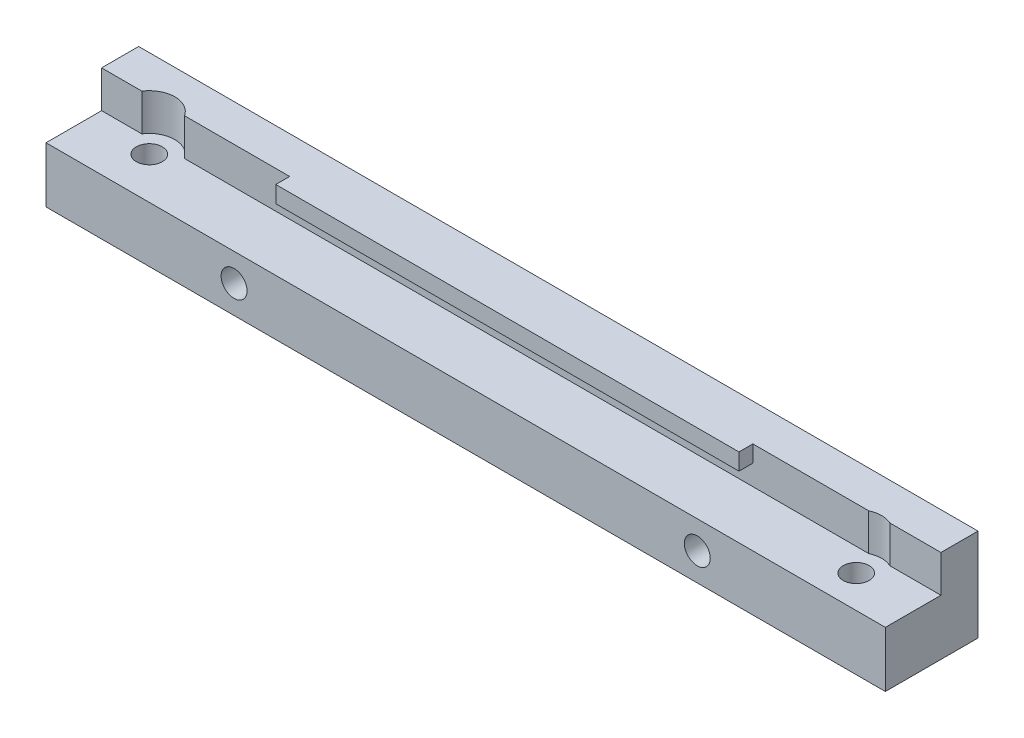
ISO-10303-21;
HEADER;
FILE_DESCRIPTION(('STEP AP214'),'2;1');
FILE_NAME('part.step','',(''),(''),'','','');
FILE_SCHEMA(('AUTOMOTIVE_DESIGN { 1 0 10303 214 1 1 1 1 }'));
ENDSEC;
DATA;
#1=APPLICATION_CONTEXT('core data for automotive mechanical design processes');
#2=APPLICATION_PROTOCOL_DEFINITION('international standard','automotive_design',2000,#1);
#3=PRODUCT_CONTEXT('',#1,'mechanical');
#4=PRODUCT('Part','Part','',(#3));
#5=PRODUCT_RELATED_PRODUCT_CATEGORY('part','',(#4));
#6=PRODUCT_DEFINITION_FORMATION('','',#4);
#7=PRODUCT_DEFINITION_CONTEXT('part definition',#1,'design');
#8=PRODUCT_DEFINITION('design','',#6,#7);
#9=PRODUCT_DEFINITION_SHAPE('','',#8);
#10=(LENGTH_UNIT() NAMED_UNIT(*) SI_UNIT(.MILLI.,.METRE.));
#11=(NAMED_UNIT(*) PLANE_ANGLE_UNIT() SI_UNIT($,.RADIAN.));
#12=(NAMED_UNIT(*) SI_UNIT($,.STERADIAN.) SOLID_ANGLE_UNIT());
#13=UNCERTAINTY_MEASURE_WITH_UNIT(LENGTH_MEASURE(1.E-05),#10,'distance_accuracy_value','');
#14=(GEOMETRIC_REPRESENTATION_CONTEXT(3) GLOBAL_UNCERTAINTY_ASSIGNED_CONTEXT((#13)) GLOBAL_UNIT_ASSIGNED_CONTEXT((#10,
#11,#12)) REPRESENTATION_CONTEXT('',''));
#15=CARTESIAN_POINT('',(0.,0.,0.));
#16=DIRECTION('',(0.,0.,1.));
#17=DIRECTION('',(1.,0.,0.));
#18=AXIS2_PLACEMENT_3D('',#15,#16,#17);
#19=CARTESIAN_POINT('',(0.,0.,4.));
#20=DIRECTION('',(0.,0.,1.));
#21=DIRECTION('',(1.,0.,0.));
#22=AXIS2_PLACEMENT_3D('',#19,#20,#21);
#23=PLANE('',#22);
#24=DIRECTION('',(0.,1.,0.));
#25=VECTOR('',#24,1.);
#26=CARTESIAN_POINT('',(85.095643923739,6.,4.));
#27=LINE('',#26,#25);
#28=CARTESIAN_POINT('',(85.095643923739,6.,4.));
#29=VERTEX_POINT('',#28);
#30=CARTESIAN_POINT('',(85.095643923739,10.,4.));
#31=VERTEX_POINT('',#30);
#32=EDGE_CURVE('E48',#29,#31,#27,.T.);
#33=ORIENTED_EDGE('',*,*,#32,.F.);
#34=DIRECTION('',(1.,0.,0.));
#35=VECTOR('',#34,1.);
#36=CARTESIAN_POINT('',(0.,6.,4.));
#37=LINE('',#36,#35);
#38=CARTESIAN_POINT('',(90.6,6.,4.));
#39=VERTEX_POINT('',#38);
#40=EDGE_CURVE('E144',#29,#39,#37,.T.);
#41=ORIENTED_EDGE('',*,*,#40,.T.);
#42=DIRECTION('',(0.,1.,0.));
#43=VECTOR('',#42,1.);
#44=CARTESIAN_POINT('',(90.6,10.,4.));
#45=LINE('',#44,#43);
#46=CARTESIAN_POINT('',(90.6,10.,4.));
#47=VERTEX_POINT('',#46);
#48=EDGE_CURVE('E164',#39,#47,#45,.T.);
#49=ORIENTED_EDGE('',*,*,#48,.T.);
#50=DIRECTION('',(-1.,0.,0.));
#51=VECTOR('',#50,1.);
#52=CARTESIAN_POINT('',(0.,10.,4.));
#53=LINE('',#52,#51);
#54=EDGE_CURVE('E147',#47,#31,#53,.T.);
#55=ORIENTED_EDGE('',*,*,#54,.T.);
#56=EDGE_LOOP('',(#33,#41,#49,#55));
#57=FACE_BOUND('',#56,.T.);
#58=ADVANCED_FACE('F33',(#57),#23,.T.);
#59=DIRECTION('',(0.,1.,0.));
#60=VECTOR('',#59,1.);
#61=CARTESIAN_POINT('',(82.804356076261,6.,4.));
#62=LINE('',#61,#60);
#63=CARTESIAN_POINT('',(82.804356076261,10.,4.));
#64=VERTEX_POINT('',#63);
#65=CARTESIAN_POINT('',(82.804356076261,6.,4.));
#66=VERTEX_POINT('',#65);
#67=EDGE_CURVE('E135',#64,#66,#62,.F.);
#68=ORIENTED_EDGE('',*,*,#67,.F.);
#69=CARTESIAN_POINT('',(70.3,10.,4.));
#70=VERTEX_POINT('',#69);
#71=EDGE_CURVE('E170',#64,#70,#53,.T.);
#72=ORIENTED_EDGE('',*,*,#71,.T.);
#73=DIRECTION('',(0.,1.,0.));
#74=VECTOR('',#73,1.);
#75=CARTESIAN_POINT('',(70.3,10.,4.));
#76=LINE('',#75,#74);
#77=CARTESIAN_POINT('',(70.3,8.2,4.));
#78=VERTEX_POINT('',#77);
#79=EDGE_CURVE('E238',#78,#70,#76,.T.);
#80=ORIENTED_EDGE('',*,*,#79,.F.);
#81=DIRECTION('',(1.,0.,0.));
#82=VECTOR('',#81,1.);
#83=CARTESIAN_POINT('',(20.3,8.2,4.));
#84=LINE('',#83,#82);
#85=CARTESIAN_POINT('',(20.3,8.2,4.));
#86=VERTEX_POINT('',#85);
#87=EDGE_CURVE('E251',#86,#78,#84,.T.);
#88=ORIENTED_EDGE('',*,*,#87,.F.);
#89=DIRECTION('',(0.,-1.,0.));
#90=VECTOR('',#89,1.);
#91=CARTESIAN_POINT('',(20.3,10.,4.));
#92=LINE('',#91,#90);
#93=CARTESIAN_POINT('',(20.3,10.,4.));
#94=VERTEX_POINT('',#93);
#95=EDGE_CURVE('E235',#94,#86,#92,.T.);
#96=ORIENTED_EDGE('',*,*,#95,.F.);
#97=CARTESIAN_POINT('',(8.95488611432322,10.,4.));
#98=VERTEX_POINT('',#97);
#99=EDGE_CURVE('E168',#94,#98,#53,.T.);
#100=ORIENTED_EDGE('',*,*,#99,.T.);
#101=DIRECTION('',(0.,1.,0.));
#102=VECTOR('',#101,1.);
#103=CARTESIAN_POINT('',(8.95488611432322,6.,4.));
#104=LINE('',#103,#102);
#105=CARTESIAN_POINT('',(8.95488611432322,6.,4.));
#106=VERTEX_POINT('',#105);
#107=EDGE_CURVE('E56',#106,#98,#104,.T.);
#108=ORIENTED_EDGE('',*,*,#107,.F.);
#109=EDGE_CURVE('E155',#106,#66,#37,.T.);
#110=ORIENTED_EDGE('',*,*,#109,.T.);
#111=EDGE_LOOP('',(#68,#72,#80,#88,#96,#100,#108,#110));
#112=FACE_BOUND('',#111,.T.);
#113=ADVANCED_FACE('F233',(#112),#23,.T.);
#114=DIRECTION('',(0.,1.,0.));
#115=VECTOR('',#114,1.);
#116=CARTESIAN_POINT('',(4.34511388567678,6.,4.));
#117=LINE('',#116,#115);
#118=CARTESIAN_POINT('',(4.34511388567678,10.,4.));
#119=VERTEX_POINT('',#118);
#120=CARTESIAN_POINT('',(4.34511388567678,6.,4.));
#121=VERTEX_POINT('',#120);
#122=EDGE_CURVE('E226',#119,#121,#117,.F.);
#123=ORIENTED_EDGE('',*,*,#122,.F.);
#124=CARTESIAN_POINT('',(0.,10.,4.));
#125=VERTEX_POINT('',#124);
#126=EDGE_CURVE('E167',#119,#125,#53,.T.);
#127=ORIENTED_EDGE('',*,*,#126,.T.);
#128=DIRECTION('',(0.,-1.,0.));
#129=VECTOR('',#128,1.);
#130=CARTESIAN_POINT('',(0.,10.,4.));
#131=LINE('',#130,#129);
#132=CARTESIAN_POINT('',(0.,6.,4.));
#133=VERTEX_POINT('',#132);
#134=EDGE_CURVE('E156',#125,#133,#131,.T.);
#135=ORIENTED_EDGE('',*,*,#134,.T.);
#136=EDGE_CURVE('E158',#133,#121,#37,.T.);
#137=ORIENTED_EDGE('',*,*,#136,.T.);
#138=EDGE_LOOP('',(#123,#127,#135,#137));
#139=FACE_BOUND('',#138,.T.);
#140=ADVANCED_FACE('F225',(#139),#23,.T.);
#141=CARTESIAN_POINT('',(0.,10.,10.));
#142=DIRECTION('',(0.,-1.,0.));
#143=DIRECTION('',(0.,0.,-1.));
#144=AXIS2_PLACEMENT_3D('',#141,#142,#143);
#145=PLANE('',#144);
#146=ORIENTED_EDGE('',*,*,#71,.F.);
#147=CARTESIAN_POINT('',(83.95,10.,6.5));
#148=DIRECTION('',(0.,1.,0.));
#149=DIRECTION('',(0.,0.,1.));
#150=AXIS2_PLACEMENT_3D('',#147,#148,#149);
#151=CIRCLE('',#150,2.75000000000001);
#152=EDGE_CURVE('E140',#31,#64,#151,.T.);
#153=ORIENTED_EDGE('',*,*,#152,.F.);
#154=ORIENTED_EDGE('',*,*,#54,.F.);
#155=DIRECTION('',(0.,0.,-1.));
#156=VECTOR('',#155,1.);
#157=CARTESIAN_POINT('',(90.6,10.,10.));
#158=LINE('',#157,#156);
#159=CARTESIAN_POINT('',(90.6,10.,0.));
#160=VERTEX_POINT('',#159);
#161=EDGE_CURVE('E197',#47,#160,#158,.T.);
#162=ORIENTED_EDGE('',*,*,#161,.T.);
#163=DIRECTION('',(-1.,0.,0.));
#164=VECTOR('',#163,1.);
#165=CARTESIAN_POINT('',(0.,10.,0.));
#166=LINE('',#165,#164);
#167=CARTESIAN_POINT('',(0.,10.,0.));
#168=VERTEX_POINT('',#167);
#169=EDGE_CURVE('E181',#160,#168,#166,.T.);
#170=ORIENTED_EDGE('',*,*,#169,.T.);
#171=DIRECTION('',(0.,0.,-1.));
#172=VECTOR('',#171,1.);
#173=CARTESIAN_POINT('',(0.,10.,10.));
#174=LINE('',#173,#172);
#175=EDGE_CURVE('E186',#125,#168,#174,.T.);
#176=ORIENTED_EDGE('',*,*,#175,.F.);
#177=ORIENTED_EDGE('',*,*,#126,.F.);
#178=CARTESIAN_POINT('',(6.65,10.,5.5));
#179=DIRECTION('',(0.,1.,0.));
#180=DIRECTION('',(0.,0.,1.));
#181=AXIS2_PLACEMENT_3D('',#178,#179,#180);
#182=CIRCLE('',#181,2.75);
#183=EDGE_CURVE('E148',#98,#119,#182,.T.);
#184=ORIENTED_EDGE('',*,*,#183,.F.);
#185=ORIENTED_EDGE('',*,*,#99,.F.);
#186=DIRECTION('',(0.,0.,-1.));
#187=VECTOR('',#186,1.);
#188=CARTESIAN_POINT('',(20.3,10.,5.5));
#189=LINE('',#188,#187);
#190=CARTESIAN_POINT('',(20.3,10.,5.5));
#191=VERTEX_POINT('',#190);
#192=EDGE_CURVE('E254',#191,#94,#189,.T.);
#193=ORIENTED_EDGE('',*,*,#192,.F.);
#194=DIRECTION('',(-1.,0.,0.));
#195=VECTOR('',#194,1.);
#196=CARTESIAN_POINT('',(20.3,10.,5.5));
#197=LINE('',#196,#195);
#198=CARTESIAN_POINT('',(70.3,10.,5.5));
#199=VERTEX_POINT('',#198);
#200=EDGE_CURVE('E253',#199,#191,#197,.T.);
#201=ORIENTED_EDGE('',*,*,#200,.F.);
#202=DIRECTION('',(0.,0.,-1.));
#203=VECTOR('',#202,1.);
#204=CARTESIAN_POINT('',(70.3,10.,5.5));
#205=LINE('',#204,#203);
#206=EDGE_CURVE('E246',#199,#70,#205,.T.);
#207=ORIENTED_EDGE('',*,*,#206,.T.);
#208=EDGE_LOOP('',(#146,#153,#154,#162,#170,#176,#177,#184,#185,#193,#201,#207));
#209=FACE_BOUND('',#208,.T.);
#210=ADVANCED_FACE('F214',(#209),#145,.F.);
#211=CARTESIAN_POINT('',(0.,0.,10.));
#212=DIRECTION('',(1.,0.,0.));
#213=DIRECTION('',(0.,0.,-1.));
#214=AXIS2_PLACEMENT_3D('',#211,#212,#213);
#215=PLANE('',#214);
#216=DIRECTION('',(0.,-1.,0.));
#217=VECTOR('',#216,1.);
#218=CARTESIAN_POINT('',(0.,0.,10.));
#219=LINE('',#218,#217);
#220=CARTESIAN_POINT('',(0.,6.,10.));
#221=VERTEX_POINT('',#220);
#222=CARTESIAN_POINT('',(0.,0.,10.));
#223=VERTEX_POINT('',#222);
#224=EDGE_CURVE('E178',#221,#223,#219,.T.);
#225=ORIENTED_EDGE('',*,*,#224,.F.);
#226=DIRECTION('',(0.,0.,1.));
#227=VECTOR('',#226,1.);
#228=CARTESIAN_POINT('',(0.,6.,4.));
#229=LINE('',#228,#227);
#230=EDGE_CURVE('E172',#133,#221,#229,.T.);
#231=ORIENTED_EDGE('',*,*,#230,.F.);
#232=ORIENTED_EDGE('',*,*,#134,.F.);
#233=ORIENTED_EDGE('',*,*,#175,.T.);
#234=DIRECTION('',(0.,-1.,0.));
#235=VECTOR('',#234,1.);
#236=CARTESIAN_POINT('',(0.,0.,0.));
#237=LINE('',#236,#235);
#238=CARTESIAN_POINT('',(0.,0.,0.));
#239=VERTEX_POINT('',#238);
#240=EDGE_CURVE('E176',#168,#239,#237,.T.);
#241=ORIENTED_EDGE('',*,*,#240,.T.);
#242=DIRECTION('',(0.,0.,-1.));
#243=VECTOR('',#242,1.);
#244=CARTESIAN_POINT('',(0.,0.,10.));
#245=LINE('',#244,#243);
#246=EDGE_CURVE('E11',#223,#239,#245,.T.);
#247=ORIENTED_EDGE('',*,*,#246,.F.);
#248=EDGE_LOOP('',(#225,#231,#232,#233,#241,#247));
#249=FACE_BOUND('',#248,.T.);
#250=ADVANCED_FACE('F35',(#249),#215,.F.);
#251=CARTESIAN_POINT('',(0.,0.,10.));
#252=DIRECTION('',(0.,1.,0.));
#253=DIRECTION('',(0.,0.,1.));
#254=AXIS2_PLACEMENT_3D('',#251,#252,#253);
#255=PLANE('',#254);
#256=CARTESIAN_POINT('',(83.95,0.,6.5));
#257=DIRECTION('',(0.,1.,0.));
#258=DIRECTION('',(0.,0.,1.));
#259=AXIS2_PLACEMENT_3D('',#256,#257,#258);
#260=CIRCLE('',#259,1.4);
#261=CARTESIAN_POINT('',(83.95,0.,7.9));
#262=VERTEX_POINT('',#261);
#263=EDGE_CURVE('E263',#262,#262,#260,.T.);
#264=ORIENTED_EDGE('',*,*,#263,.T.);
#265=EDGE_LOOP('',(#264));
#266=FACE_BOUND('',#265,.T.);
#267=CARTESIAN_POINT('',(6.65,0.,5.5));
#268=DIRECTION('',(0.,1.,0.));
#269=DIRECTION('',(0.,0.,1.));
#270=AXIS2_PLACEMENT_3D('',#267,#268,#269);
#271=CIRCLE('',#270,1.4);
#272=CARTESIAN_POINT('',(6.65,0.,6.9));
#273=VERTEX_POINT('',#272);
#274=EDGE_CURVE('E174',#273,#273,#271,.T.);
#275=ORIENTED_EDGE('',*,*,#274,.T.);
#276=EDGE_LOOP('',(#275));
#277=FACE_BOUND('',#276,.T.);
#278=DIRECTION('',(1.,0.,0.));
#279=VECTOR('',#278,1.);
#280=CARTESIAN_POINT('',(0.,0.,0.));
#281=LINE('',#280,#279);
#282=CARTESIAN_POINT('',(90.6,0.,0.));
#283=VERTEX_POINT('',#282);
#284=EDGE_CURVE('E189',#239,#283,#281,.T.);
#285=ORIENTED_EDGE('',*,*,#284,.T.);
#286=DIRECTION('',(0.,0.,-1.));
#287=VECTOR('',#286,1.);
#288=CARTESIAN_POINT('',(90.6,0.,10.));
#289=LINE('',#288,#287);
#290=CARTESIAN_POINT('',(90.6,0.,10.));
#291=VERTEX_POINT('',#290);
#292=EDGE_CURVE('E41',#291,#283,#289,.T.);
#293=ORIENTED_EDGE('',*,*,#292,.F.);
#294=DIRECTION('',(1.,0.,0.));
#295=VECTOR('',#294,1.);
#296=CARTESIAN_POINT('',(0.,0.,10.));
#297=LINE('',#296,#295);
#298=EDGE_CURVE('E180',#223,#291,#297,.T.);
#299=ORIENTED_EDGE('',*,*,#298,.F.);
#300=ORIENTED_EDGE('',*,*,#246,.T.);
#301=EDGE_LOOP('',(#285,#293,#299,#300));
#302=FACE_BOUND('',#301,.T.);
#303=ADVANCED_FACE('F221',(#266,#277,#302),#255,.F.);
#304=CARTESIAN_POINT('',(90.6,0.,10.));
#305=DIRECTION('',(-1.,0.,0.));
#306=DIRECTION('',(0.,0.,1.));
#307=AXIS2_PLACEMENT_3D('',#304,#305,#306);
#308=PLANE('',#307);
#309=ORIENTED_EDGE('',*,*,#48,.F.);
#310=DIRECTION('',(0.,0.,1.));
#311=VECTOR('',#310,1.);
#312=CARTESIAN_POINT('',(90.6,6.,4.));
#313=LINE('',#312,#311);
#314=CARTESIAN_POINT('',(90.6,6.,10.));
#315=VERTEX_POINT('',#314);
#316=EDGE_CURVE('E153',#39,#315,#313,.T.);
#317=ORIENTED_EDGE('',*,*,#316,.T.);
#318=DIRECTION('',(0.,1.,0.));
#319=VECTOR('',#318,1.);
#320=CARTESIAN_POINT('',(90.6,0.,10.));
#321=LINE('',#320,#319);
#322=EDGE_CURVE('E183',#291,#315,#321,.T.);
#323=ORIENTED_EDGE('',*,*,#322,.F.);
#324=ORIENTED_EDGE('',*,*,#292,.T.);
#325=DIRECTION('',(0.,1.,0.));
#326=VECTOR('',#325,1.);
#327=CARTESIAN_POINT('',(90.6,0.,0.));
#328=LINE('',#327,#326);
#329=EDGE_CURVE('E191',#283,#160,#328,.T.);
#330=ORIENTED_EDGE('',*,*,#329,.T.);
#331=ORIENTED_EDGE('',*,*,#161,.F.);
#332=EDGE_LOOP('',(#309,#317,#323,#324,#330,#331));
#333=FACE_BOUND('',#332,.T.);
#334=ADVANCED_FACE('F203',(#333),#308,.F.);
#335=CARTESIAN_POINT('',(0.,0.,10.));
#336=DIRECTION('',(0.,0.,-1.));
#337=DIRECTION('',(-1.,0.,0.));
#338=AXIS2_PLACEMENT_3D('',#335,#336,#337);
#339=PLANE('',#338);
#340=CARTESIAN_POINT('',(70.3,3.,10.));
#341=DIRECTION('',(0.,0.,1.));
#342=DIRECTION('',(1.,0.,0.));
#343=AXIS2_PLACEMENT_3D('',#340,#341,#342);
#344=CIRCLE('',#343,1.4);
#345=CARTESIAN_POINT('',(71.7,3.,10.));
#346=VERTEX_POINT('',#345);
#347=EDGE_CURVE('E456',#346,#346,#344,.T.);
#348=ORIENTED_EDGE('',*,*,#347,.F.);
#349=EDGE_LOOP('',(#348));
#350=FACE_BOUND('',#349,.T.);
#351=CARTESIAN_POINT('',(20.3,3.,10.));
#352=DIRECTION('',(0.,0.,1.));
#353=DIRECTION('',(1.,0.,0.));
#354=AXIS2_PLACEMENT_3D('',#351,#352,#353);
#355=CIRCLE('',#354,1.4);
#356=CARTESIAN_POINT('',(21.7,3.,10.));
#357=VERTEX_POINT('',#356);
#358=EDGE_CURVE('E458',#357,#357,#355,.T.);
#359=ORIENTED_EDGE('',*,*,#358,.F.);
#360=EDGE_LOOP('',(#359));
#361=FACE_BOUND('',#360,.T.);
#362=ORIENTED_EDGE('',*,*,#322,.T.);
#363=DIRECTION('',(1.,0.,0.));
#364=VECTOR('',#363,1.);
#365=CARTESIAN_POINT('',(0.,6.,10.));
#366=LINE('',#365,#364);
#367=EDGE_CURVE('E160',#221,#315,#366,.T.);
#368=ORIENTED_EDGE('',*,*,#367,.F.);
#369=ORIENTED_EDGE('',*,*,#224,.T.);
#370=ORIENTED_EDGE('',*,*,#298,.T.);
#371=EDGE_LOOP('',(#362,#368,#369,#370));
#372=FACE_BOUND('',#371,.T.);
#373=ADVANCED_FACE('F218',(#350,#361,#372),#339,.F.);
#374=CARTESIAN_POINT('',(0.,0.,0.));
#375=DIRECTION('',(0.,0.,-1.));
#376=DIRECTION('',(-1.,0.,0.));
#377=AXIS2_PLACEMENT_3D('',#374,#375,#376);
#378=PLANE('',#377);
#379=CARTESIAN_POINT('',(70.3,3.,0.));
#380=DIRECTION('',(0.,0.,1.));
#381=DIRECTION('',(1.,0.,0.));
#382=AXIS2_PLACEMENT_3D('',#379,#380,#381);
#383=CIRCLE('',#382,1.4);
#384=CARTESIAN_POINT('',(71.7,3.,0.));
#385=VERTEX_POINT('',#384);
#386=EDGE_CURVE('E453',#385,#385,#383,.T.);
#387=ORIENTED_EDGE('',*,*,#386,.T.);
#388=EDGE_LOOP('',(#387));
#389=FACE_BOUND('',#388,.T.);
#390=CARTESIAN_POINT('',(20.3,3.,0.));
#391=DIRECTION('',(0.,0.,1.));
#392=DIRECTION('',(1.,0.,0.));
#393=AXIS2_PLACEMENT_3D('',#390,#391,#392);
#394=CIRCLE('',#393,1.4);
#395=CARTESIAN_POINT('',(21.7,3.,0.));
#396=VERTEX_POINT('',#395);
#397=EDGE_CURVE('E461',#396,#396,#394,.T.);
#398=ORIENTED_EDGE('',*,*,#397,.T.);
#399=EDGE_LOOP('',(#398));
#400=FACE_BOUND('',#399,.T.);
#401=ORIENTED_EDGE('',*,*,#240,.F.);
#402=ORIENTED_EDGE('',*,*,#169,.F.);
#403=ORIENTED_EDGE('',*,*,#329,.F.);
#404=ORIENTED_EDGE('',*,*,#284,.F.);
#405=EDGE_LOOP('',(#401,#402,#403,#404));
#406=FACE_BOUND('',#405,.T.);
#407=ADVANCED_FACE('F210',(#389,#400,#406),#378,.T.);
#408=CARTESIAN_POINT('',(0.,6.,4.));
#409=DIRECTION('',(0.,-1.,0.));
#410=DIRECTION('',(0.,0.,-1.));
#411=AXIS2_PLACEMENT_3D('',#408,#409,#410);
#412=PLANE('',#411);
#413=ORIENTED_EDGE('',*,*,#40,.F.);
#414=CARTESIAN_POINT('',(83.95,6.,6.5));
#415=DIRECTION('',(0.,1.,0.));
#416=DIRECTION('',(0.,0.,1.));
#417=AXIS2_PLACEMENT_3D('',#414,#415,#416);
#418=CIRCLE('',#417,2.75000000000001);
#419=EDGE_CURVE('E132',#29,#66,#418,.T.);
#420=ORIENTED_EDGE('',*,*,#419,.T.);
#421=ORIENTED_EDGE('',*,*,#109,.F.);
#422=CARTESIAN_POINT('',(6.65,6.,5.5));
#423=DIRECTION('',(0.,1.,0.));
#424=DIRECTION('',(0.,0.,1.));
#425=AXIS2_PLACEMENT_3D('',#422,#423,#424);
#426=CIRCLE('',#425,2.75);
#427=EDGE_CURVE('E230',#106,#121,#426,.T.);
#428=ORIENTED_EDGE('',*,*,#427,.T.);
#429=ORIENTED_EDGE('',*,*,#136,.F.);
#430=ORIENTED_EDGE('',*,*,#230,.T.);
#431=ORIENTED_EDGE('',*,*,#367,.T.);
#432=ORIENTED_EDGE('',*,*,#316,.F.);
#433=EDGE_LOOP('',(#413,#420,#421,#428,#429,#430,#431,#432));
#434=FACE_BOUND('',#433,.T.);
#435=CARTESIAN_POINT('',(6.65,6.,5.5));
#436=DIRECTION('',(0.,1.,0.));
#437=DIRECTION('',(0.,0.,1.));
#438=AXIS2_PLACEMENT_3D('',#435,#436,#437);
#439=CIRCLE('',#438,1.4);
#440=CARTESIAN_POINT('',(6.65,6.,6.9));
#441=VERTEX_POINT('',#440);
#442=EDGE_CURVE('E266',#441,#441,#439,.T.);
#443=ORIENTED_EDGE('',*,*,#442,.F.);
#444=EDGE_LOOP('',(#443));
#445=FACE_BOUND('',#444,.T.);
#446=CARTESIAN_POINT('',(83.95,6.,6.5));
#447=DIRECTION('',(0.,1.,0.));
#448=DIRECTION('',(0.,0.,1.));
#449=AXIS2_PLACEMENT_3D('',#446,#447,#448);
#450=CIRCLE('',#449,1.4);
#451=CARTESIAN_POINT('',(83.95,6.,7.9));
#452=VERTEX_POINT('',#451);
#453=EDGE_CURVE('E262',#452,#452,#450,.T.);
#454=ORIENTED_EDGE('',*,*,#453,.F.);
#455=EDGE_LOOP('',(#454));
#456=FACE_BOUND('',#455,.T.);
#457=ADVANCED_FACE('F150',(#434,#445,#456),#412,.F.);
#458=CARTESIAN_POINT('',(6.65,0.,5.5));
#459=DIRECTION('',(0.,1.,0.));
#460=DIRECTION('',(0.,0.,1.));
#461=AXIS2_PLACEMENT_3D('',#458,#459,#460);
#462=CYLINDRICAL_SURFACE('',#461,1.4);
#463=ORIENTED_EDGE('',*,*,#274,.F.);
#464=EDGE_LOOP('',(#463));
#465=FACE_BOUND('',#464,.T.);
#466=ORIENTED_EDGE('',*,*,#442,.T.);
#467=EDGE_LOOP('',(#466));
#468=FACE_BOUND('',#467,.T.);
#469=ADVANCED_FACE('F274',(#465,#468),#462,.F.);
#470=CARTESIAN_POINT('',(83.95,0.,6.5));
#471=DIRECTION('',(0.,1.,0.));
#472=DIRECTION('',(0.,0.,1.));
#473=AXIS2_PLACEMENT_3D('',#470,#471,#472);
#474=CYLINDRICAL_SURFACE('',#473,1.4);
#475=ORIENTED_EDGE('',*,*,#263,.F.);
#476=EDGE_LOOP('',(#475));
#477=FACE_BOUND('',#476,.T.);
#478=ORIENTED_EDGE('',*,*,#453,.T.);
#479=EDGE_LOOP('',(#478));
#480=FACE_BOUND('',#479,.T.);
#481=ADVANCED_FACE('F280',(#477,#480),#474,.F.);
#482=CARTESIAN_POINT('',(20.3,10.,5.5));
#483=DIRECTION('',(1.,0.,0.));
#484=DIRECTION('',(0.,1.,0.));
#485=AXIS2_PLACEMENT_3D('',#482,#483,#484);
#486=PLANE('',#485);
#487=ORIENTED_EDGE('',*,*,#95,.T.);
#488=DIRECTION('',(0.,0.,-1.));
#489=VECTOR('',#488,1.);
#490=CARTESIAN_POINT('',(20.3,8.2,5.5));
#491=LINE('',#490,#489);
#492=CARTESIAN_POINT('',(20.3,8.2,5.5));
#493=VERTEX_POINT('',#492);
#494=EDGE_CURVE('E256',#493,#86,#491,.T.);
#495=ORIENTED_EDGE('',*,*,#494,.F.);
#496=DIRECTION('',(0.,-1.,0.));
#497=VECTOR('',#496,1.);
#498=CARTESIAN_POINT('',(20.3,10.,5.5));
#499=LINE('',#498,#497);
#500=EDGE_CURVE('E250',#191,#493,#499,.T.);
#501=ORIENTED_EDGE('',*,*,#500,.F.);
#502=ORIENTED_EDGE('',*,*,#192,.T.);
#503=EDGE_LOOP('',(#487,#495,#501,#502));
#504=FACE_BOUND('',#503,.T.);
#505=ADVANCED_FACE('F282',(#504),#486,.F.);
#506=CARTESIAN_POINT('',(20.3,8.2,5.5));
#507=DIRECTION('',(0.,1.,0.));
#508=DIRECTION('',(0.,0.,1.));
#509=AXIS2_PLACEMENT_3D('',#506,#507,#508);
#510=PLANE('',#509);
#511=ORIENTED_EDGE('',*,*,#87,.T.);
#512=DIRECTION('',(0.,0.,-1.));
#513=VECTOR('',#512,1.);
#514=CARTESIAN_POINT('',(70.3,8.2,5.5));
#515=LINE('',#514,#513);
#516=CARTESIAN_POINT('',(70.3,8.2,5.5));
#517=VERTEX_POINT('',#516);
#518=EDGE_CURVE('E249',#517,#78,#515,.T.);
#519=ORIENTED_EDGE('',*,*,#518,.F.);
#520=DIRECTION('',(1.,0.,0.));
#521=VECTOR('',#520,1.);
#522=CARTESIAN_POINT('',(20.3,8.2,5.5));
#523=LINE('',#522,#521);
#524=EDGE_CURVE('E474',#493,#517,#523,.T.);
#525=ORIENTED_EDGE('',*,*,#524,.F.);
#526=ORIENTED_EDGE('',*,*,#494,.T.);
#527=EDGE_LOOP('',(#511,#519,#525,#526));
#528=FACE_BOUND('',#527,.T.);
#529=ADVANCED_FACE('F289',(#528),#510,.F.);
#530=CARTESIAN_POINT('',(70.3,10.,5.5));
#531=DIRECTION('',(-1.,0.,0.));
#532=DIRECTION('',(0.,0.,1.));
#533=AXIS2_PLACEMENT_3D('',#530,#531,#532);
#534=PLANE('',#533);
#535=ORIENTED_EDGE('',*,*,#79,.T.);
#536=ORIENTED_EDGE('',*,*,#206,.F.);
#537=DIRECTION('',(0.,1.,0.));
#538=VECTOR('',#537,1.);
#539=CARTESIAN_POINT('',(70.3,10.,5.5));
#540=LINE('',#539,#538);
#541=EDGE_CURVE('E476',#517,#199,#540,.T.);
#542=ORIENTED_EDGE('',*,*,#541,.F.);
#543=ORIENTED_EDGE('',*,*,#518,.T.);
#544=EDGE_LOOP('',(#535,#536,#542,#543));
#545=FACE_BOUND('',#544,.T.);
#546=ADVANCED_FACE('F244',(#545),#534,.F.);
#547=CARTESIAN_POINT('',(0.,0.,5.5));
#548=DIRECTION('',(0.,0.,1.));
#549=DIRECTION('',(1.,0.,0.));
#550=AXIS2_PLACEMENT_3D('',#547,#548,#549);
#551=PLANE('',#550);
#552=ORIENTED_EDGE('',*,*,#500,.T.);
#553=ORIENTED_EDGE('',*,*,#524,.T.);
#554=ORIENTED_EDGE('',*,*,#541,.T.);
#555=ORIENTED_EDGE('',*,*,#200,.T.);
#556=EDGE_LOOP('',(#552,#553,#554,#555));
#557=FACE_BOUND('',#556,.T.);
#558=ADVANCED_FACE('F378',(#557),#551,.T.);
#559=CARTESIAN_POINT('',(6.65,6.,5.5));
#560=DIRECTION('',(0.,1.,0.));
#561=DIRECTION('',(0.,0.,1.));
#562=AXIS2_PLACEMENT_3D('',#559,#560,#561);
#563=CYLINDRICAL_SURFACE('',#562,2.75);
#564=ORIENTED_EDGE('',*,*,#107,.T.);
#565=ORIENTED_EDGE('',*,*,#183,.T.);
#566=ORIENTED_EDGE('',*,*,#122,.T.);
#567=ORIENTED_EDGE('',*,*,#427,.F.);
#568=EDGE_LOOP('',(#564,#565,#566,#567));
#569=FACE_BOUND('',#568,.T.);
#570=ADVANCED_FACE('F386',(#569),#563,.F.);
#571=CARTESIAN_POINT('',(83.95,6.,6.5));
#572=DIRECTION('',(0.,1.,0.));
#573=DIRECTION('',(0.,0.,1.));
#574=AXIS2_PLACEMENT_3D('',#571,#572,#573);
#575=CYLINDRICAL_SURFACE('',#574,2.75000000000001);
#576=ORIENTED_EDGE('',*,*,#32,.T.);
#577=ORIENTED_EDGE('',*,*,#152,.T.);
#578=ORIENTED_EDGE('',*,*,#67,.T.);
#579=ORIENTED_EDGE('',*,*,#419,.F.);
#580=EDGE_LOOP('',(#576,#577,#578,#579));
#581=FACE_BOUND('',#580,.T.);
#582=ADVANCED_FACE('F133',(#581),#575,.F.);
#583=CARTESIAN_POINT('',(20.3,3.,0.));
#584=DIRECTION('',(0.,0.,1.));
#585=DIRECTION('',(1.,0.,0.));
#586=AXIS2_PLACEMENT_3D('',#583,#584,#585);
#587=CYLINDRICAL_SURFACE('',#586,1.4);
#588=ORIENTED_EDGE('',*,*,#397,.F.);
#589=EDGE_LOOP('',(#588));
#590=FACE_BOUND('',#589,.T.);
#591=ORIENTED_EDGE('',*,*,#358,.T.);
#592=EDGE_LOOP('',(#591));
#593=FACE_BOUND('',#592,.T.);
#594=ADVANCED_FACE('F428',(#590,#593),#587,.F.);
#595=CARTESIAN_POINT('',(70.3,3.,0.));
#596=DIRECTION('',(0.,0.,1.));
#597=DIRECTION('',(1.,0.,0.));
#598=AXIS2_PLACEMENT_3D('',#595,#596,#597);
#599=CYLINDRICAL_SURFACE('',#598,1.4);
#600=ORIENTED_EDGE('',*,*,#386,.F.);
#601=EDGE_LOOP('',(#600));
#602=FACE_BOUND('',#601,.T.);
#603=ORIENTED_EDGE('',*,*,#347,.T.);
#604=EDGE_LOOP('',(#603));
#605=FACE_BOUND('',#604,.T.);
#606=ADVANCED_FACE('F435',(#602,#605),#599,.F.);
#607=CLOSED_SHELL('',(#58,#113,#140,#210,#250,#303,#334,#373,#407,#457,#469,#481,#505,#529,#546,
#558,#570,#582,#594,#606));
#608=MANIFOLD_SOLID_BREP('B2',#607);
#609=ADVANCED_BREP_SHAPE_REPRESENTATION('',(#18,#608),#14);
#610=SHAPE_DEFINITION_REPRESENTATION(#9,#609);
ENDSEC;
END-ISO-10303-21;
